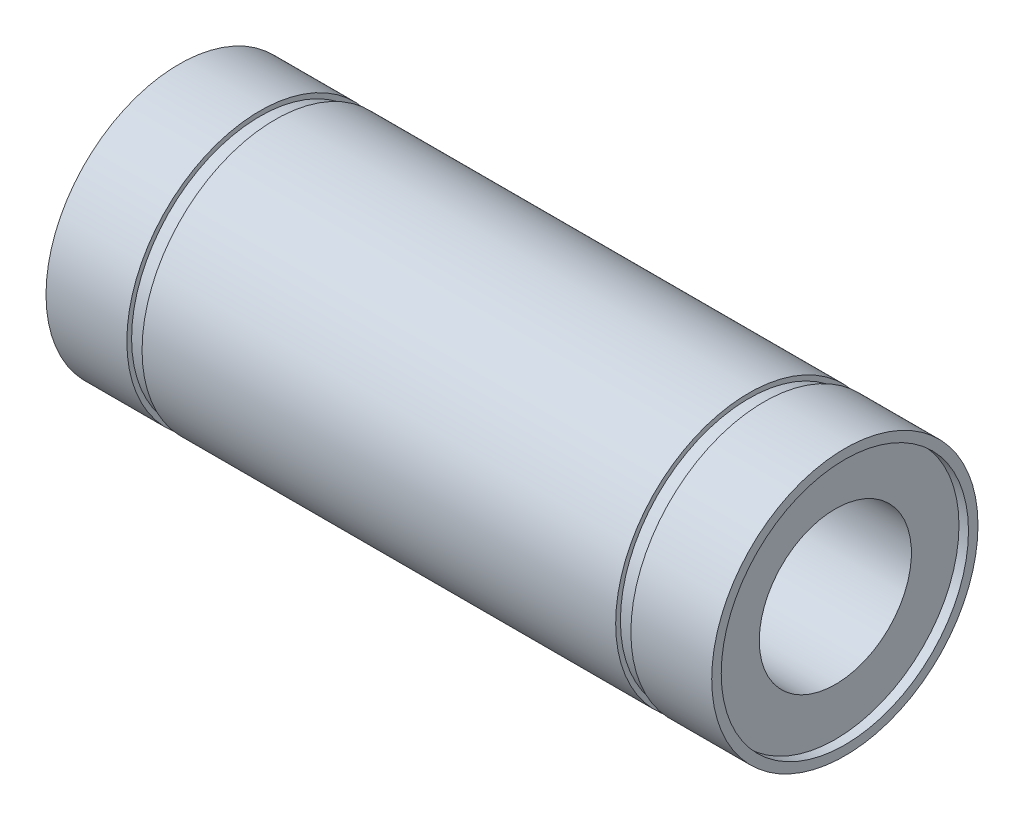
ISO-10303-21;
HEADER;
FILE_DESCRIPTION(('STEP AP214'),'2;1');
FILE_NAME('part.step','',(''),(''),'','','');
FILE_SCHEMA(('AUTOMOTIVE_DESIGN { 1 0 10303 214 1 1 1 1 }'));
ENDSEC;
DATA;
#1=APPLICATION_CONTEXT('core data for automotive mechanical design processes');
#2=APPLICATION_PROTOCOL_DEFINITION('international standard','automotive_design',2000,#1);
#3=PRODUCT_CONTEXT('',#1,'mechanical');
#4=PRODUCT('Part','Part','',(#3));
#5=PRODUCT_RELATED_PRODUCT_CATEGORY('part','',(#4));
#6=PRODUCT_DEFINITION_FORMATION('','',#4);
#7=PRODUCT_DEFINITION_CONTEXT('part definition',#1,'design');
#8=PRODUCT_DEFINITION('design','',#6,#7);
#9=PRODUCT_DEFINITION_SHAPE('','',#8);
#10=(LENGTH_UNIT() NAMED_UNIT(*) SI_UNIT(.MILLI.,.METRE.));
#11=(NAMED_UNIT(*) PLANE_ANGLE_UNIT() SI_UNIT($,.RADIAN.));
#12=(NAMED_UNIT(*) SI_UNIT($,.STERADIAN.) SOLID_ANGLE_UNIT());
#13=UNCERTAINTY_MEASURE_WITH_UNIT(LENGTH_MEASURE(1.E-05),#10,'distance_accuracy_value','');
#14=(GEOMETRIC_REPRESENTATION_CONTEXT(3) GLOBAL_UNCERTAINTY_ASSIGNED_CONTEXT((#13)) GLOBAL_UNIT_ASSIGNED_CONTEXT((#10,
#11,#12)) REPRESENTATION_CONTEXT('',''));
#15=CARTESIAN_POINT('',(0.,0.,0.));
#16=DIRECTION('',(0.,0.,1.));
#17=DIRECTION('',(1.,0.,0.));
#18=AXIS2_PLACEMENT_3D('',#15,#16,#17);
#19=CARTESIAN_POINT('',(-35.,0.,0.));
#20=DIRECTION('',(-1.,0.,0.));
#21=DIRECTION('',(0.,0.,1.));
#22=AXIS2_PLACEMENT_3D('',#19,#20,#21);
#23=CYLINDRICAL_SURFACE('',#22,14.);
#24=CARTESIAN_POINT('',(26.5,0.,0.));
#25=DIRECTION('',(-1.,0.,0.));
#26=DIRECTION('',(0.,0.,1.));
#27=AXIS2_PLACEMENT_3D('',#24,#25,#26);
#28=CIRCLE('',#27,14.);
#29=CARTESIAN_POINT('',(26.5,0.,14.));
#30=VERTEX_POINT('',#29);
#31=EDGE_CURVE('E10',#30,#30,#28,.T.);
#32=ORIENTED_EDGE('',*,*,#31,.F.);
#33=EDGE_LOOP('',(#32));
#34=FACE_BOUND('',#33,.T.);
#35=CARTESIAN_POINT('',(35.,0.,0.));
#36=DIRECTION('',(-1.,0.,0.));
#37=DIRECTION('',(0.,0.,1.));
#38=AXIS2_PLACEMENT_3D('',#35,#36,#37);
#39=CIRCLE('',#38,14.);
#40=CARTESIAN_POINT('',(35.,0.,14.));
#41=VERTEX_POINT('',#40);
#42=EDGE_CURVE('E85',#41,#41,#39,.T.);
#43=ORIENTED_EDGE('',*,*,#42,.T.);
#44=EDGE_LOOP('',(#43));
#45=FACE_BOUND('',#44,.T.);
#46=ADVANCED_FACE('F33',(#34,#45),#23,.T.);
#47=CARTESIAN_POINT('',(26.5,13.5,0.));
#48=DIRECTION('',(1.,0.,0.));
#49=DIRECTION('',(0.,0.,-1.));
#50=AXIS2_PLACEMENT_3D('',#47,#48,#49);
#51=PLANE('',#50);
#52=CARTESIAN_POINT('',(26.5,0.,0.));
#53=DIRECTION('',(-1.,0.,0.));
#54=DIRECTION('',(0.,0.,1.));
#55=AXIS2_PLACEMENT_3D('',#52,#53,#54);
#56=CIRCLE('',#55,13.5);
#57=CARTESIAN_POINT('',(26.5,0.,13.5));
#58=VERTEX_POINT('',#57);
#59=EDGE_CURVE('E39',#58,#58,#56,.T.);
#60=ORIENTED_EDGE('',*,*,#59,.F.);
#61=EDGE_LOOP('',(#60));
#62=FACE_BOUND('',#61,.T.);
#63=ORIENTED_EDGE('',*,*,#31,.T.);
#64=EDGE_LOOP('',(#63));
#65=FACE_BOUND('',#64,.T.);
#66=ADVANCED_FACE('F170',(#62,#65),#51,.F.);
#67=CARTESIAN_POINT('',(-35.,0.,0.));
#68=DIRECTION('',(-1.,0.,0.));
#69=DIRECTION('',(0.,0.,1.));
#70=AXIS2_PLACEMENT_3D('',#67,#68,#69);
#71=CYLINDRICAL_SURFACE('',#70,13.5);
#72=CARTESIAN_POINT('',(24.9,0.,0.));
#73=DIRECTION('',(-1.,0.,0.));
#74=DIRECTION('',(0.,0.,1.));
#75=AXIS2_PLACEMENT_3D('',#72,#73,#74);
#76=CIRCLE('',#75,13.5);
#77=CARTESIAN_POINT('',(24.9,0.,13.5));
#78=VERTEX_POINT('',#77);
#79=EDGE_CURVE('E43',#78,#78,#76,.T.);
#80=ORIENTED_EDGE('',*,*,#79,.F.);
#81=EDGE_LOOP('',(#80));
#82=FACE_BOUND('',#81,.T.);
#83=ORIENTED_EDGE('',*,*,#59,.T.);
#84=EDGE_LOOP('',(#83));
#85=FACE_BOUND('',#84,.T.);
#86=ADVANCED_FACE('F165',(#82,#85),#71,.T.);
#87=CARTESIAN_POINT('',(24.9,14.,0.));
#88=DIRECTION('',(-1.,0.,0.));
#89=DIRECTION('',(0.,0.,1.));
#90=AXIS2_PLACEMENT_3D('',#87,#88,#89);
#91=PLANE('',#90);
#92=CARTESIAN_POINT('',(24.9,0.,0.));
#93=DIRECTION('',(-1.,0.,0.));
#94=DIRECTION('',(0.,0.,1.));
#95=AXIS2_PLACEMENT_3D('',#92,#93,#94);
#96=CIRCLE('',#95,14.);
#97=CARTESIAN_POINT('',(24.9,0.,14.));
#98=VERTEX_POINT('',#97);
#99=EDGE_CURVE('E47',#98,#98,#96,.T.);
#100=ORIENTED_EDGE('',*,*,#99,.F.);
#101=EDGE_LOOP('',(#100));
#102=FACE_BOUND('',#101,.T.);
#103=ORIENTED_EDGE('',*,*,#79,.T.);
#104=EDGE_LOOP('',(#103));
#105=FACE_BOUND('',#104,.T.);
#106=ADVANCED_FACE('F159',(#102,#105),#91,.F.);
#107=CARTESIAN_POINT('',(-35.,0.,0.));
#108=DIRECTION('',(-1.,0.,0.));
#109=DIRECTION('',(0.,0.,1.));
#110=AXIS2_PLACEMENT_3D('',#107,#108,#109);
#111=CYLINDRICAL_SURFACE('',#110,14.);
#112=CARTESIAN_POINT('',(-24.9,0.,0.));
#113=DIRECTION('',(-1.,0.,0.));
#114=DIRECTION('',(0.,0.,1.));
#115=AXIS2_PLACEMENT_3D('',#112,#113,#114);
#116=CIRCLE('',#115,14.);
#117=CARTESIAN_POINT('',(-24.9,0.,14.));
#118=VERTEX_POINT('',#117);
#119=EDGE_CURVE('E52',#118,#118,#116,.T.);
#120=ORIENTED_EDGE('',*,*,#119,.F.);
#121=EDGE_LOOP('',(#120));
#122=FACE_BOUND('',#121,.T.);
#123=ORIENTED_EDGE('',*,*,#99,.T.);
#124=EDGE_LOOP('',(#123));
#125=FACE_BOUND('',#124,.T.);
#126=ADVANCED_FACE('F153',(#122,#125),#111,.T.);
#127=CARTESIAN_POINT('',(-24.9,14.,0.));
#128=DIRECTION('',(1.,0.,0.));
#129=DIRECTION('',(0.,0.,-1.));
#130=AXIS2_PLACEMENT_3D('',#127,#128,#129);
#131=PLANE('',#130);
#132=CARTESIAN_POINT('',(-24.9,0.,0.));
#133=DIRECTION('',(-1.,0.,0.));
#134=DIRECTION('',(0.,0.,1.));
#135=AXIS2_PLACEMENT_3D('',#132,#133,#134);
#136=CIRCLE('',#135,13.5);
#137=CARTESIAN_POINT('',(-24.9,0.,13.5));
#138=VERTEX_POINT('',#137);
#139=EDGE_CURVE('E55',#138,#138,#136,.T.);
#140=ORIENTED_EDGE('',*,*,#139,.F.);
#141=EDGE_LOOP('',(#140));
#142=FACE_BOUND('',#141,.T.);
#143=ORIENTED_EDGE('',*,*,#119,.T.);
#144=EDGE_LOOP('',(#143));
#145=FACE_BOUND('',#144,.T.);
#146=ADVANCED_FACE('F147',(#142,#145),#131,.F.);
#147=CARTESIAN_POINT('',(-35.,0.,0.));
#148=DIRECTION('',(-1.,0.,0.));
#149=DIRECTION('',(0.,0.,1.));
#150=AXIS2_PLACEMENT_3D('',#147,#148,#149);
#151=CYLINDRICAL_SURFACE('',#150,13.5);
#152=CARTESIAN_POINT('',(-26.5,0.,0.));
#153=DIRECTION('',(-1.,0.,0.));
#154=DIRECTION('',(0.,0.,1.));
#155=AXIS2_PLACEMENT_3D('',#152,#153,#154);
#156=CIRCLE('',#155,13.5);
#157=CARTESIAN_POINT('',(-26.5,0.,13.5));
#158=VERTEX_POINT('',#157);
#159=EDGE_CURVE('E58',#158,#158,#156,.T.);
#160=ORIENTED_EDGE('',*,*,#159,.F.);
#161=EDGE_LOOP('',(#160));
#162=FACE_BOUND('',#161,.T.);
#163=ORIENTED_EDGE('',*,*,#139,.T.);
#164=EDGE_LOOP('',(#163));
#165=FACE_BOUND('',#164,.T.);
#166=ADVANCED_FACE('F141',(#162,#165),#151,.T.);
#167=CARTESIAN_POINT('',(-26.5,13.5,0.));
#168=DIRECTION('',(-1.,0.,0.));
#169=DIRECTION('',(0.,0.,1.));
#170=AXIS2_PLACEMENT_3D('',#167,#168,#169);
#171=PLANE('',#170);
#172=CARTESIAN_POINT('',(-26.5,0.,0.));
#173=DIRECTION('',(-1.,0.,0.));
#174=DIRECTION('',(0.,0.,1.));
#175=AXIS2_PLACEMENT_3D('',#172,#173,#174);
#176=CIRCLE('',#175,14.);
#177=CARTESIAN_POINT('',(-26.5,0.,14.));
#178=VERTEX_POINT('',#177);
#179=EDGE_CURVE('E61',#178,#178,#176,.T.);
#180=ORIENTED_EDGE('',*,*,#179,.F.);
#181=EDGE_LOOP('',(#180));
#182=FACE_BOUND('',#181,.T.);
#183=ORIENTED_EDGE('',*,*,#159,.T.);
#184=EDGE_LOOP('',(#183));
#185=FACE_BOUND('',#184,.T.);
#186=ADVANCED_FACE('F135',(#182,#185),#171,.F.);
#187=CARTESIAN_POINT('',(-35.,0.,0.));
#188=DIRECTION('',(-1.,0.,0.));
#189=DIRECTION('',(0.,0.,1.));
#190=AXIS2_PLACEMENT_3D('',#187,#188,#189);
#191=CYLINDRICAL_SURFACE('',#190,14.);
#192=CARTESIAN_POINT('',(-35.,0.,0.));
#193=DIRECTION('',(-1.,0.,0.));
#194=DIRECTION('',(0.,0.,1.));
#195=AXIS2_PLACEMENT_3D('',#192,#193,#194);
#196=CIRCLE('',#195,14.);
#197=CARTESIAN_POINT('',(-35.,0.,14.));
#198=VERTEX_POINT('',#197);
#199=EDGE_CURVE('E64',#198,#198,#196,.T.);
#200=ORIENTED_EDGE('',*,*,#199,.F.);
#201=EDGE_LOOP('',(#200));
#202=FACE_BOUND('',#201,.T.);
#203=ORIENTED_EDGE('',*,*,#179,.T.);
#204=EDGE_LOOP('',(#203));
#205=FACE_BOUND('',#204,.T.);
#206=ADVANCED_FACE('F129',(#202,#205),#191,.T.);
#207=CARTESIAN_POINT('',(-35.,13.,0.));
#208=DIRECTION('',(1.,0.,0.));
#209=DIRECTION('',(0.,0.,-1.));
#210=AXIS2_PLACEMENT_3D('',#207,#208,#209);
#211=PLANE('',#210);
#212=CARTESIAN_POINT('',(-35.,0.,0.));
#213=DIRECTION('',(-1.,0.,0.));
#214=DIRECTION('',(0.,0.,1.));
#215=AXIS2_PLACEMENT_3D('',#212,#213,#214);
#216=CIRCLE('',#215,13.);
#217=CARTESIAN_POINT('',(-35.,0.,13.));
#218=VERTEX_POINT('',#217);
#219=EDGE_CURVE('E67',#218,#218,#216,.T.);
#220=ORIENTED_EDGE('',*,*,#219,.F.);
#221=EDGE_LOOP('',(#220));
#222=FACE_BOUND('',#221,.T.);
#223=ORIENTED_EDGE('',*,*,#199,.T.);
#224=EDGE_LOOP('',(#223));
#225=FACE_BOUND('',#224,.T.);
#226=ADVANCED_FACE('F123',(#222,#225),#211,.F.);
#227=CARTESIAN_POINT('',(-35.,0.,0.));
#228=DIRECTION('',(-1.,0.,0.));
#229=DIRECTION('',(0.,0.,1.));
#230=AXIS2_PLACEMENT_3D('',#227,#228,#229);
#231=CYLINDRICAL_SURFACE('',#230,13.);
#232=CARTESIAN_POINT('',(-34.,0.,0.));
#233=DIRECTION('',(-1.,0.,0.));
#234=DIRECTION('',(0.,0.,1.));
#235=AXIS2_PLACEMENT_3D('',#232,#233,#234);
#236=CIRCLE('',#235,13.);
#237=CARTESIAN_POINT('',(-34.,0.,13.));
#238=VERTEX_POINT('',#237);
#239=EDGE_CURVE('E70',#238,#238,#236,.T.);
#240=ORIENTED_EDGE('',*,*,#239,.F.);
#241=EDGE_LOOP('',(#240));
#242=FACE_BOUND('',#241,.T.);
#243=ORIENTED_EDGE('',*,*,#219,.T.);
#244=EDGE_LOOP('',(#243));
#245=FACE_BOUND('',#244,.T.);
#246=ADVANCED_FACE('F117',(#242,#245),#231,.F.);
#247=CARTESIAN_POINT('',(-34.,13.,0.));
#248=DIRECTION('',(1.,0.,0.));
#249=DIRECTION('',(0.,0.,-1.));
#250=AXIS2_PLACEMENT_3D('',#247,#248,#249);
#251=PLANE('',#250);
#252=CARTESIAN_POINT('',(-34.,0.,0.));
#253=DIRECTION('',(-1.,0.,0.));
#254=DIRECTION('',(0.,0.,1.));
#255=AXIS2_PLACEMENT_3D('',#252,#253,#254);
#256=CIRCLE('',#255,7.99999999999999);
#257=CARTESIAN_POINT('',(-34.,0.,7.99999999999999));
#258=VERTEX_POINT('',#257);
#259=EDGE_CURVE('E73',#258,#258,#256,.T.);
#260=ORIENTED_EDGE('',*,*,#259,.F.);
#261=EDGE_LOOP('',(#260));
#262=FACE_BOUND('',#261,.T.);
#263=ORIENTED_EDGE('',*,*,#239,.T.);
#264=EDGE_LOOP('',(#263));
#265=FACE_BOUND('',#264,.T.);
#266=ADVANCED_FACE('F111',(#262,#265),#251,.F.);
#267=CARTESIAN_POINT('',(-35.,0.,0.));
#268=DIRECTION('',(-1.,0.,0.));
#269=DIRECTION('',(0.,0.,1.));
#270=AXIS2_PLACEMENT_3D('',#267,#268,#269);
#271=CYLINDRICAL_SURFACE('',#270,7.99999999999999);
#272=CARTESIAN_POINT('',(34.,0.,0.));
#273=DIRECTION('',(-1.,0.,0.));
#274=DIRECTION('',(0.,0.,1.));
#275=AXIS2_PLACEMENT_3D('',#272,#273,#274);
#276=CIRCLE('',#275,7.99999999999999);
#277=CARTESIAN_POINT('',(34.,0.,7.99999999999999));
#278=VERTEX_POINT('',#277);
#279=EDGE_CURVE('E76',#278,#278,#276,.T.);
#280=ORIENTED_EDGE('',*,*,#279,.F.);
#281=EDGE_LOOP('',(#280));
#282=FACE_BOUND('',#281,.T.);
#283=ORIENTED_EDGE('',*,*,#259,.T.);
#284=EDGE_LOOP('',(#283));
#285=FACE_BOUND('',#284,.T.);
#286=ADVANCED_FACE('F105',(#282,#285),#271,.F.);
#287=CARTESIAN_POINT('',(34.,13.,0.));
#288=DIRECTION('',(-1.,0.,0.));
#289=DIRECTION('',(0.,0.,1.));
#290=AXIS2_PLACEMENT_3D('',#287,#288,#289);
#291=PLANE('',#290);
#292=CARTESIAN_POINT('',(34.,0.,0.));
#293=DIRECTION('',(-1.,0.,0.));
#294=DIRECTION('',(0.,0.,1.));
#295=AXIS2_PLACEMENT_3D('',#292,#293,#294);
#296=CIRCLE('',#295,13.);
#297=CARTESIAN_POINT('',(34.,0.,13.));
#298=VERTEX_POINT('',#297);
#299=EDGE_CURVE('E79',#298,#298,#296,.T.);
#300=ORIENTED_EDGE('',*,*,#299,.F.);
#301=EDGE_LOOP('',(#300));
#302=FACE_BOUND('',#301,.T.);
#303=ORIENTED_EDGE('',*,*,#279,.T.);
#304=EDGE_LOOP('',(#303));
#305=FACE_BOUND('',#304,.T.);
#306=ADVANCED_FACE('F99',(#302,#305),#291,.F.);
#307=CARTESIAN_POINT('',(-35.,0.,0.));
#308=DIRECTION('',(-1.,0.,0.));
#309=DIRECTION('',(0.,0.,1.));
#310=AXIS2_PLACEMENT_3D('',#307,#308,#309);
#311=CYLINDRICAL_SURFACE('',#310,13.);
#312=CARTESIAN_POINT('',(35.,0.,0.));
#313=DIRECTION('',(-1.,0.,0.));
#314=DIRECTION('',(0.,0.,1.));
#315=AXIS2_PLACEMENT_3D('',#312,#313,#314);
#316=CIRCLE('',#315,13.);
#317=CARTESIAN_POINT('',(35.,0.,13.));
#318=VERTEX_POINT('',#317);
#319=EDGE_CURVE('E82',#318,#318,#316,.T.);
#320=ORIENTED_EDGE('',*,*,#319,.F.);
#321=EDGE_LOOP('',(#320));
#322=FACE_BOUND('',#321,.T.);
#323=ORIENTED_EDGE('',*,*,#299,.T.);
#324=EDGE_LOOP('',(#323));
#325=FACE_BOUND('',#324,.T.);
#326=ADVANCED_FACE('F93',(#322,#325),#311,.F.);
#327=CARTESIAN_POINT('',(35.,13.,0.));
#328=DIRECTION('',(-1.,0.,0.));
#329=DIRECTION('',(0.,0.,1.));
#330=AXIS2_PLACEMENT_3D('',#327,#328,#329);
#331=PLANE('',#330);
#332=ORIENTED_EDGE('',*,*,#42,.F.);
#333=EDGE_LOOP('',(#332));
#334=FACE_BOUND('',#333,.T.);
#335=ORIENTED_EDGE('',*,*,#319,.T.);
#336=EDGE_LOOP('',(#335));
#337=FACE_BOUND('',#336,.T.);
#338=ADVANCED_FACE('F90',(#334,#337),#331,.F.);
#339=CLOSED_SHELL('',(#46,#66,#86,#106,#126,#146,#166,#186,#206,#226,#246,#266,#286,#306,#326,#338));
#340=MANIFOLD_SOLID_BREP('B2',#339);
#341=ADVANCED_BREP_SHAPE_REPRESENTATION('',(#18,#340),#14);
#342=SHAPE_DEFINITION_REPRESENTATION(#9,#341);
ENDSEC;
END-ISO-10303-21;
